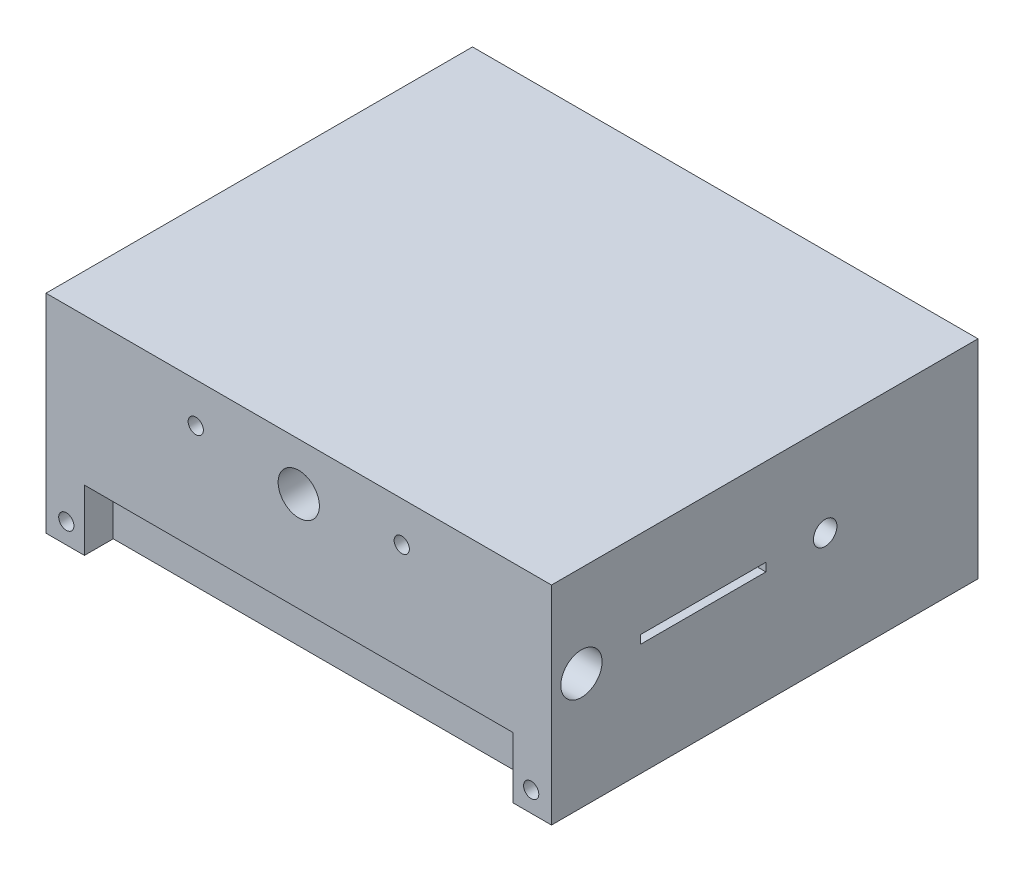
ISO-10303-21;
HEADER;
FILE_DESCRIPTION(('STEP AP214'),'2;1');
FILE_NAME('part.step','',(''),(''),'','','');
FILE_SCHEMA(('AUTOMOTIVE_DESIGN { 1 0 10303 214 1 1 1 1 }'));
ENDSEC;
DATA;
#1=APPLICATION_CONTEXT('core data for automotive mechanical design processes');
#2=APPLICATION_PROTOCOL_DEFINITION('international standard','automotive_design',2000,#1);
#3=PRODUCT_CONTEXT('',#1,'mechanical');
#4=PRODUCT('Part','Part','',(#3));
#5=PRODUCT_RELATED_PRODUCT_CATEGORY('part','',(#4));
#6=PRODUCT_DEFINITION_FORMATION('','',#4);
#7=PRODUCT_DEFINITION_CONTEXT('part definition',#1,'design');
#8=PRODUCT_DEFINITION('design','',#6,#7);
#9=PRODUCT_DEFINITION_SHAPE('','',#8);
#10=(LENGTH_UNIT() NAMED_UNIT(*) SI_UNIT(.MILLI.,.METRE.));
#11=(NAMED_UNIT(*) PLANE_ANGLE_UNIT() SI_UNIT($,.RADIAN.));
#12=(NAMED_UNIT(*) SI_UNIT($,.STERADIAN.) SOLID_ANGLE_UNIT());
#13=UNCERTAINTY_MEASURE_WITH_UNIT(LENGTH_MEASURE(1.E-05),#10,'distance_accuracy_value','');
#14=(GEOMETRIC_REPRESENTATION_CONTEXT(3) GLOBAL_UNCERTAINTY_ASSIGNED_CONTEXT((#13)) GLOBAL_UNIT_ASSIGNED_CONTEXT((#10,
#11,#12)) REPRESENTATION_CONTEXT('',''));
#15=CARTESIAN_POINT('',(0.,0.,0.));
#16=DIRECTION('',(0.,0.,1.));
#17=DIRECTION('',(1.,0.,0.));
#18=AXIS2_PLACEMENT_3D('',#15,#16,#17);
#19=CARTESIAN_POINT('',(316.09292636,-65.00344505,-133.35));
#20=DIRECTION('',(0.,0.,1.));
#21=DIRECTION('',(1.,0.,0.));
#22=AXIS2_PLACEMENT_3D('',#19,#20,#21);
#23=PLANE('',#22);
#24=CARTESIAN_POINT('',(93.639440102,39.990297972,-133.35));
#25=DIRECTION('',(0.,0.,1.));
#26=DIRECTION('',(1.,0.,0.));
#27=AXIS2_PLACEMENT_3D('',#24,#25,#26);
#28=CIRCLE('',#27,4.7625);
#29=CARTESIAN_POINT('',(98.401940102,39.990297972,-133.35));
#30=VERTEX_POINT('',#29);
#31=EDGE_CURVE('E313',#30,#30,#28,.T.);
#32=ORIENTED_EDGE('',*,*,#31,.T.);
#33=EDGE_LOOP('',(#32));
#34=FACE_BOUND('',#33,.T.);
#35=CARTESIAN_POINT('',(222.453486258,39.990297972,-133.35));
#36=DIRECTION('',(0.,0.,1.));
#37=DIRECTION('',(1.,0.,0.));
#38=AXIS2_PLACEMENT_3D('',#35,#36,#37);
#39=CIRCLE('',#38,4.76250000000001);
#40=CARTESIAN_POINT('',(227.215986258,39.990297972,-133.35));
#41=VERTEX_POINT('',#40);
#42=EDGE_CURVE('E285',#41,#41,#39,.T.);
#43=ORIENTED_EDGE('',*,*,#42,.T.);
#44=EDGE_LOOP('',(#43));
#45=FACE_BOUND('',#44,.T.);
#46=CARTESIAN_POINT('',(303.39292636,-52.30344505,-133.35));
#47=DIRECTION('',(0.,0.,1.));
#48=DIRECTION('',(1.,0.,0.));
#49=AXIS2_PLACEMENT_3D('',#46,#47,#48);
#50=CIRCLE('',#49,4.76250000000001);
#51=CARTESIAN_POINT('',(308.15542636,-52.30344505,-133.35));
#52=VERTEX_POINT('',#51);
#53=EDGE_CURVE('E293',#52,#52,#50,.T.);
#54=ORIENTED_EDGE('',*,*,#53,.T.);
#55=EDGE_LOOP('',(#54));
#56=FACE_BOUND('',#55,.T.);
#57=CARTESIAN_POINT('',(12.7,-52.30344505,-133.35));
#58=DIRECTION('',(0.,0.,1.));
#59=DIRECTION('',(1.,0.,0.));
#60=AXIS2_PLACEMENT_3D('',#57,#58,#59);
#61=CIRCLE('',#60,4.7625);
#62=CARTESIAN_POINT('',(17.4625,-52.30344505,-133.35));
#63=VERTEX_POINT('',#62);
#64=EDGE_CURVE('E301',#63,#63,#61,.T.);
#65=ORIENTED_EDGE('',*,*,#64,.T.);
#66=EDGE_LOOP('',(#65));
#67=FACE_BOUND('',#66,.T.);
#68=CARTESIAN_POINT('',(158.04646318,35.218991284,-133.35));
#69=DIRECTION('',(0.,0.,1.));
#70=DIRECTION('',(1.,0.,0.));
#71=AXIS2_PLACEMENT_3D('',#68,#69,#70);
#72=CIRCLE('',#71,12.8984375);
#73=CARTESIAN_POINT('',(170.94490068,35.218991284,-133.35));
#74=VERTEX_POINT('',#73);
#75=EDGE_CURVE('E309',#74,#74,#72,.T.);
#76=ORIENTED_EDGE('',*,*,#75,.T.);
#77=EDGE_LOOP('',(#76));
#78=FACE_BOUND('',#77,.T.);
#79=DIRECTION('',(0.,-1.,0.));
#80=VECTOR('',#79,1.);
#81=CARTESIAN_POINT('',(24.049603666,-65.00344505,-133.35));
#82=LINE('',#81,#80);
#83=CARTESIAN_POINT('',(24.049603666,-26.90344505,-133.35));
#84=VERTEX_POINT('',#83);
#85=CARTESIAN_POINT('',(24.049603666,-65.00344505,-133.35));
#86=VERTEX_POINT('',#85);
#87=EDGE_CURVE('E175',#84,#86,#82,.T.);
#88=ORIENTED_EDGE('',*,*,#87,.T.);
#89=DIRECTION('',(-1.,0.,0.));
#90=VECTOR('',#89,1.);
#91=CARTESIAN_POINT('',(316.09292636,-65.00344505,-133.35));
#92=LINE('',#91,#90);
#93=CARTESIAN_POINT('',(0.,-65.00344505,-133.35));
#94=VERTEX_POINT('',#93);
#95=EDGE_CURVE('E335',#86,#94,#92,.T.);
#96=ORIENTED_EDGE('',*,*,#95,.T.);
#97=DIRECTION('',(0.,1.,0.));
#98=VECTOR('',#97,1.);
#99=CARTESIAN_POINT('',(0.,-65.00344505,-133.35));
#100=LINE('',#99,#98);
#101=CARTESIAN_POINT('',(0.,65.00344505,-133.35));
#102=VERTEX_POINT('',#101);
#103=EDGE_CURVE('E317',#94,#102,#100,.T.);
#104=ORIENTED_EDGE('',*,*,#103,.T.);
#105=DIRECTION('',(-1.,0.,0.));
#106=VECTOR('',#105,1.);
#107=CARTESIAN_POINT('',(316.09292636,65.00344505,-133.35));
#108=LINE('',#107,#106);
#109=CARTESIAN_POINT('',(316.09292636,65.00344505,-133.35));
#110=VERTEX_POINT('',#109);
#111=EDGE_CURVE('E362',#110,#102,#108,.T.);
#112=ORIENTED_EDGE('',*,*,#111,.F.);
#113=DIRECTION('',(0.,1.,0.));
#114=VECTOR('',#113,1.);
#115=CARTESIAN_POINT('',(316.09292636,-65.00344505,-133.35));
#116=LINE('',#115,#114);
#117=CARTESIAN_POINT('',(316.09292636,-65.00344505,-133.35));
#118=VERTEX_POINT('',#117);
#119=EDGE_CURVE('E321',#118,#110,#116,.T.);
#120=ORIENTED_EDGE('',*,*,#119,.F.);
#121=CARTESIAN_POINT('',(292.043322694,-65.00344505,-133.35));
#122=VERTEX_POINT('',#121);
#123=EDGE_CURVE('E349',#118,#122,#92,.T.);
#124=ORIENTED_EDGE('',*,*,#123,.T.);
#125=DIRECTION('',(0.,1.,0.));
#126=VECTOR('',#125,1.);
#127=CARTESIAN_POINT('',(292.043322694,-65.00344505,-133.35));
#128=LINE('',#127,#126);
#129=CARTESIAN_POINT('',(292.043322694,-26.90344505,-133.35));
#130=VERTEX_POINT('',#129);
#131=EDGE_CURVE('E183',#122,#130,#128,.T.);
#132=ORIENTED_EDGE('',*,*,#131,.T.);
#133=DIRECTION('',(-1.,0.,0.));
#134=VECTOR('',#133,1.);
#135=CARTESIAN_POINT('',(24.049603666,-26.90344505,-133.35));
#136=LINE('',#135,#134);
#137=EDGE_CURVE('E187',#130,#84,#136,.T.);
#138=ORIENTED_EDGE('',*,*,#137,.T.);
#139=EDGE_LOOP('',(#88,#96,#104,#112,#120,#124,#132,#138));
#140=FACE_BOUND('',#139,.T.);
#141=ADVANCED_FACE('F44',(#34,#45,#56,#67,#78,#140),#23,.F.);
#142=CARTESIAN_POINT('',(316.09292636,-65.00344505,133.35));
#143=DIRECTION('',(0.,1.,0.));
#144=DIRECTION('',(0.,0.,1.));
#145=AXIS2_PLACEMENT_3D('',#142,#143,#144);
#146=PLANE('',#145);
#147=DIRECTION('',(0.,0.,-1.));
#148=VECTOR('',#147,1.);
#149=CARTESIAN_POINT('',(24.049603666,-65.00344505,-115.349999932));
#150=LINE('',#149,#148);
#151=CARTESIAN_POINT('',(24.049603666,-65.00344505,-115.349999932));
#152=VERTEX_POINT('',#151);
#153=EDGE_CURVE('E198',#152,#86,#150,.T.);
#154=ORIENTED_EDGE('',*,*,#153,.F.);
#155=DIRECTION('',(1.,0.,0.));
#156=VECTOR('',#155,1.);
#157=CARTESIAN_POINT('',(24.049603666,-65.00344505,-115.349999932));
#158=LINE('',#157,#156);
#159=CARTESIAN_POINT('',(292.043322694,-65.00344505,-115.349999932));
#160=VERTEX_POINT('',#159);
#161=EDGE_CURVE('E178',#152,#160,#158,.T.);
#162=ORIENTED_EDGE('',*,*,#161,.T.);
#163=DIRECTION('',(0.,0.,-1.));
#164=VECTOR('',#163,1.);
#165=CARTESIAN_POINT('',(292.043322694,-65.00344505,-115.349999932));
#166=LINE('',#165,#164);
#167=EDGE_CURVE('E202',#160,#122,#166,.T.);
#168=ORIENTED_EDGE('',*,*,#167,.T.);
#169=ORIENTED_EDGE('',*,*,#123,.F.);
#170=DIRECTION('',(0.,0.,-1.));
#171=VECTOR('',#170,1.);
#172=CARTESIAN_POINT('',(316.09292636,-65.00344505,133.35));
#173=LINE('',#172,#171);
#174=CARTESIAN_POINT('',(316.09292636,-65.00344505,133.35));
#175=VERTEX_POINT('',#174);
#176=EDGE_CURVE('E332',#175,#118,#173,.T.);
#177=ORIENTED_EDGE('',*,*,#176,.F.);
#178=DIRECTION('',(-1.,0.,0.));
#179=VECTOR('',#178,1.);
#180=CARTESIAN_POINT('',(316.09292636,-65.00344505,133.35));
#181=LINE('',#180,#179);
#182=CARTESIAN_POINT('',(292.043322694,-65.00344505,133.35));
#183=VERTEX_POINT('',#182);
#184=EDGE_CURVE('E354',#175,#183,#181,.T.);
#185=ORIENTED_EDGE('',*,*,#184,.T.);
#186=DIRECTION('',(0.,0.,1.));
#187=VECTOR('',#186,1.);
#188=CARTESIAN_POINT('',(292.043322694,-65.00344505,115.349999932));
#189=LINE('',#188,#187);
#190=CARTESIAN_POINT('',(292.043322694,-65.00344505,115.349999932));
#191=VERTEX_POINT('',#190);
#192=EDGE_CURVE('E238',#191,#183,#189,.T.);
#193=ORIENTED_EDGE('',*,*,#192,.F.);
#194=DIRECTION('',(1.,0.,0.));
#195=VECTOR('',#194,1.);
#196=CARTESIAN_POINT('',(24.049603666,-65.00344505,115.349999932));
#197=LINE('',#196,#195);
#198=CARTESIAN_POINT('',(24.049603666,-65.00344505,115.349999932));
#199=VERTEX_POINT('',#198);
#200=EDGE_CURVE('E210',#199,#191,#197,.T.);
#201=ORIENTED_EDGE('',*,*,#200,.F.);
#202=DIRECTION('',(0.,0.,1.));
#203=VECTOR('',#202,1.);
#204=CARTESIAN_POINT('',(24.049603666,-65.00344505,115.349999932));
#205=LINE('',#204,#203);
#206=CARTESIAN_POINT('',(24.049603666,-65.00344505,133.35));
#207=VERTEX_POINT('',#206);
#208=EDGE_CURVE('E221',#199,#207,#205,.T.);
#209=ORIENTED_EDGE('',*,*,#208,.T.);
#210=CARTESIAN_POINT('',(0.,-65.00344505,133.35));
#211=VERTEX_POINT('',#210);
#212=EDGE_CURVE('E353',#207,#211,#181,.T.);
#213=ORIENTED_EDGE('',*,*,#212,.T.);
#214=DIRECTION('',(0.,0.,-1.));
#215=VECTOR('',#214,1.);
#216=CARTESIAN_POINT('',(0.,-65.00344505,133.35));
#217=LINE('',#216,#215);
#218=EDGE_CURVE('E326',#211,#94,#217,.T.);
#219=ORIENTED_EDGE('',*,*,#218,.T.);
#220=ORIENTED_EDGE('',*,*,#95,.F.);
#221=EDGE_LOOP('',(#154,#162,#168,#169,#177,#185,#193,#201,#209,#213,#219,#220));
#222=FACE_BOUND('',#221,.T.);
#223=ADVANCED_FACE('F405',(#222),#146,.F.);
#224=CARTESIAN_POINT('',(316.09292636,65.00344505,133.35));
#225=DIRECTION('',(0.,-1.,0.));
#226=DIRECTION('',(0.,0.,-1.));
#227=AXIS2_PLACEMENT_3D('',#224,#225,#226);
#228=PLANE('',#227);
#229=DIRECTION('',(0.,0.,1.));
#230=VECTOR('',#229,1.);
#231=CARTESIAN_POINT('',(0.,65.00344505,133.35));
#232=LINE('',#231,#230);
#233=CARTESIAN_POINT('',(0.,65.00344505,133.35));
#234=VERTEX_POINT('',#233);
#235=EDGE_CURVE('E339',#102,#234,#232,.T.);
#236=ORIENTED_EDGE('',*,*,#235,.T.);
#237=DIRECTION('',(-1.,0.,0.));
#238=VECTOR('',#237,1.);
#239=CARTESIAN_POINT('',(316.09292636,65.00344505,133.35));
#240=LINE('',#239,#238);
#241=CARTESIAN_POINT('',(316.09292636,65.00344505,133.35));
#242=VERTEX_POINT('',#241);
#243=EDGE_CURVE('E358',#242,#234,#240,.T.);
#244=ORIENTED_EDGE('',*,*,#243,.F.);
#245=DIRECTION('',(0.,0.,1.));
#246=VECTOR('',#245,1.);
#247=CARTESIAN_POINT('',(316.09292636,65.00344505,133.35));
#248=LINE('',#247,#246);
#249=EDGE_CURVE('E325',#110,#242,#248,.T.);
#250=ORIENTED_EDGE('',*,*,#249,.F.);
#251=ORIENTED_EDGE('',*,*,#111,.T.);
#252=EDGE_LOOP('',(#236,#244,#250,#251));
#253=FACE_BOUND('',#252,.T.);
#254=ADVANCED_FACE('F416',(#253),#228,.F.);
#255=CARTESIAN_POINT('',(316.09292636,-65.00344505,133.35));
#256=DIRECTION('',(0.,0.,-1.));
#257=DIRECTION('',(-1.,0.,0.));
#258=AXIS2_PLACEMENT_3D('',#255,#256,#257);
#259=PLANE('',#258);
#260=CARTESIAN_POINT('',(158.04646318,35.218991284,133.35));
#261=DIRECTION('',(0.,0.,1.));
#262=DIRECTION('',(1.,0.,0.));
#263=AXIS2_PLACEMENT_3D('',#260,#261,#262);
#264=CIRCLE('',#263,12.8984375);
#265=CARTESIAN_POINT('',(170.94490068,35.218991284,133.35));
#266=VERTEX_POINT('',#265);
#267=EDGE_CURVE('E305',#266,#266,#264,.T.);
#268=ORIENTED_EDGE('',*,*,#267,.F.);
#269=EDGE_LOOP('',(#268));
#270=FACE_BOUND('',#269,.T.);
#271=CARTESIAN_POINT('',(12.7,-52.30344505,133.35));
#272=DIRECTION('',(0.,0.,1.));
#273=DIRECTION('',(1.,0.,0.));
#274=AXIS2_PLACEMENT_3D('',#271,#272,#273);
#275=CIRCLE('',#274,4.7625);
#276=CARTESIAN_POINT('',(17.4625,-52.30344505,133.35));
#277=VERTEX_POINT('',#276);
#278=EDGE_CURVE('E297',#277,#277,#275,.T.);
#279=ORIENTED_EDGE('',*,*,#278,.F.);
#280=EDGE_LOOP('',(#279));
#281=FACE_BOUND('',#280,.T.);
#282=CARTESIAN_POINT('',(303.39292636,-52.30344505,133.35));
#283=DIRECTION('',(0.,0.,1.));
#284=DIRECTION('',(1.,0.,0.));
#285=AXIS2_PLACEMENT_3D('',#282,#283,#284);
#286=CIRCLE('',#285,4.76250000000001);
#287=CARTESIAN_POINT('',(308.15542636,-52.30344505,133.35));
#288=VERTEX_POINT('',#287);
#289=EDGE_CURVE('E289',#288,#288,#286,.T.);
#290=ORIENTED_EDGE('',*,*,#289,.F.);
#291=EDGE_LOOP('',(#290));
#292=FACE_BOUND('',#291,.T.);
#293=CARTESIAN_POINT('',(222.453486258,39.990297972,133.35));
#294=DIRECTION('',(0.,0.,1.));
#295=DIRECTION('',(1.,0.,0.));
#296=AXIS2_PLACEMENT_3D('',#293,#294,#295);
#297=CIRCLE('',#296,4.76250000000001);
#298=CARTESIAN_POINT('',(227.215986258,39.990297972,133.35));
#299=VERTEX_POINT('',#298);
#300=EDGE_CURVE('E280',#299,#299,#297,.T.);
#301=ORIENTED_EDGE('',*,*,#300,.F.);
#302=EDGE_LOOP('',(#301));
#303=FACE_BOUND('',#302,.T.);
#304=CARTESIAN_POINT('',(93.639440102,39.990297972,133.35));
#305=DIRECTION('',(0.,0.,1.));
#306=DIRECTION('',(1.,0.,0.));
#307=AXIS2_PLACEMENT_3D('',#304,#305,#306);
#308=CIRCLE('',#307,4.7625);
#309=CARTESIAN_POINT('',(98.401940102,39.990297972,133.35));
#310=VERTEX_POINT('',#309);
#311=EDGE_CURVE('E284',#310,#310,#308,.T.);
#312=ORIENTED_EDGE('',*,*,#311,.F.);
#313=EDGE_LOOP('',(#312));
#314=FACE_BOUND('',#313,.T.);
#315=ORIENTED_EDGE('',*,*,#212,.F.);
#316=DIRECTION('',(0.,-1.,0.));
#317=VECTOR('',#316,1.);
#318=CARTESIAN_POINT('',(24.049603666,-65.00344505,133.35));
#319=LINE('',#318,#317);
#320=CARTESIAN_POINT('',(24.049603666,-26.90344505,133.35));
#321=VERTEX_POINT('',#320);
#322=EDGE_CURVE('E201',#321,#207,#319,.T.);
#323=ORIENTED_EDGE('',*,*,#322,.F.);
#324=DIRECTION('',(-1.,0.,0.));
#325=VECTOR('',#324,1.);
#326=CARTESIAN_POINT('',(24.049603666,-26.90344505,133.35));
#327=LINE('',#326,#325);
#328=CARTESIAN_POINT('',(292.043322694,-26.90344505,133.35));
#329=VERTEX_POINT('',#328);
#330=EDGE_CURVE('E211',#329,#321,#327,.T.);
#331=ORIENTED_EDGE('',*,*,#330,.F.);
#332=DIRECTION('',(0.,1.,0.));
#333=VECTOR('',#332,1.);
#334=CARTESIAN_POINT('',(292.043322694,-65.00344505,133.35));
#335=LINE('',#334,#333);
#336=EDGE_CURVE('E224',#183,#329,#335,.T.);
#337=ORIENTED_EDGE('',*,*,#336,.F.);
#338=ORIENTED_EDGE('',*,*,#184,.F.);
#339=DIRECTION('',(0.,-1.,0.));
#340=VECTOR('',#339,1.);
#341=CARTESIAN_POINT('',(316.09292636,-65.00344505,133.35));
#342=LINE('',#341,#340);
#343=EDGE_CURVE('E329',#242,#175,#342,.T.);
#344=ORIENTED_EDGE('',*,*,#343,.F.);
#345=ORIENTED_EDGE('',*,*,#243,.T.);
#346=DIRECTION('',(0.,-1.,0.));
#347=VECTOR('',#346,1.);
#348=CARTESIAN_POINT('',(0.,-65.00344505,133.35));
#349=LINE('',#348,#347);
#350=EDGE_CURVE('E342',#234,#211,#349,.T.);
#351=ORIENTED_EDGE('',*,*,#350,.T.);
#352=EDGE_LOOP('',(#315,#323,#331,#337,#338,#344,#345,#351));
#353=FACE_BOUND('',#352,.T.);
#354=ADVANCED_FACE('F411',(#270,#281,#292,#303,#314,#353),#259,.F.);
#355=CARTESIAN_POINT('',(316.09292636,0.,0.));
#356=DIRECTION('',(-1.,0.,0.));
#357=DIRECTION('',(0.,0.,1.));
#358=AXIS2_PLACEMENT_3D('',#355,#356,#357);
#359=PLANE('',#358);
#360=CARTESIAN_POINT('',(316.09292636,7.67564504999998,114.617463678));
#361=DIRECTION('',(1.,0.,0.));
#362=DIRECTION('',(0.,0.,-1.));
#363=AXIS2_PLACEMENT_3D('',#360,#361,#362);
#364=CIRCLE('',#363,12.8984375);
#365=CARTESIAN_POINT('',(316.09292636,7.67564504999998,101.719026178));
#366=VERTEX_POINT('',#365);
#367=EDGE_CURVE('E244',#366,#366,#364,.T.);
#368=ORIENTED_EDGE('',*,*,#367,.F.);
#369=EDGE_LOOP('',(#368));
#370=FACE_BOUND('',#369,.T.);
#371=CARTESIAN_POINT('',(316.09292636,7.67564505,-37.782536322));
#372=DIRECTION('',(1.,0.,0.));
#373=DIRECTION('',(0.,0.,-1.));
#374=AXIS2_PLACEMENT_3D('',#371,#372,#373);
#375=CIRCLE('',#374,7.3421875);
#376=CARTESIAN_POINT('',(316.09292636,7.67564505,-45.124723822));
#377=VERTEX_POINT('',#376);
#378=EDGE_CURVE('E249',#377,#377,#375,.T.);
#379=ORIENTED_EDGE('',*,*,#378,.F.);
#380=EDGE_LOOP('',(#379));
#381=FACE_BOUND('',#380,.T.);
#382=DIRECTION('',(0.,0.,1.));
#383=VECTOR('',#382,1.);
#384=CARTESIAN_POINT('',(316.09292636,10.306895058,77.561250008));
#385=LINE('',#384,#383);
#386=CARTESIAN_POINT('',(316.09292636,10.306895058,-0.726250007999987));
#387=VERTEX_POINT('',#386);
#388=CARTESIAN_POINT('',(316.09292636,10.306895058,77.561250008));
#389=VERTEX_POINT('',#388);
#390=EDGE_CURVE('E274',#387,#389,#385,.T.);
#391=ORIENTED_EDGE('',*,*,#390,.F.);
#392=DIRECTION('',(0.,1.,0.));
#393=VECTOR('',#392,1.);
#394=CARTESIAN_POINT('',(316.09292636,5.04439504199999,-0.726250007999987));
#395=LINE('',#394,#393);
#396=CARTESIAN_POINT('',(316.09292636,5.04439504199999,-0.726250007999987));
#397=VERTEX_POINT('',#396);
#398=EDGE_CURVE('E253',#397,#387,#395,.T.);
#399=ORIENTED_EDGE('',*,*,#398,.F.);
#400=DIRECTION('',(0.,0.,-1.));
#401=VECTOR('',#400,1.);
#402=CARTESIAN_POINT('',(316.09292636,5.04439504199998,77.561250008));
#403=LINE('',#402,#401);
#404=CARTESIAN_POINT('',(316.09292636,5.04439504199998,77.561250008));
#405=VERTEX_POINT('',#404);
#406=EDGE_CURVE('E258',#405,#397,#403,.T.);
#407=ORIENTED_EDGE('',*,*,#406,.F.);
#408=DIRECTION('',(0.,-1.,0.));
#409=VECTOR('',#408,1.);
#410=CARTESIAN_POINT('',(316.09292636,5.04439504199998,77.561250008));
#411=LINE('',#410,#409);
#412=EDGE_CURVE('E270',#389,#405,#411,.T.);
#413=ORIENTED_EDGE('',*,*,#412,.F.);
#414=EDGE_LOOP('',(#391,#399,#407,#413));
#415=FACE_BOUND('',#414,.T.);
#416=ORIENTED_EDGE('',*,*,#119,.T.);
#417=ORIENTED_EDGE('',*,*,#249,.T.);
#418=ORIENTED_EDGE('',*,*,#343,.T.);
#419=ORIENTED_EDGE('',*,*,#176,.T.);
#420=EDGE_LOOP('',(#416,#417,#418,#419));
#421=FACE_BOUND('',#420,.T.);
#422=ADVANCED_FACE('F389',(#370,#381,#415,#421),#359,.F.);
#423=CARTESIAN_POINT('',(0.,0.,0.));
#424=DIRECTION('',(-1.,0.,0.));
#425=DIRECTION('',(0.,0.,1.));
#426=AXIS2_PLACEMENT_3D('',#423,#424,#425);
#427=PLANE('',#426);
#428=CARTESIAN_POINT('',(0.,7.67564504999998,114.617463678));
#429=DIRECTION('',(-1.,0.,0.));
#430=DIRECTION('',(0.,0.,1.));
#431=AXIS2_PLACEMENT_3D('',#428,#429,#430);
#432=CIRCLE('',#431,12.8984375);
#433=CARTESIAN_POINT('',(0.,7.67564504999998,127.515901178));
#434=VERTEX_POINT('',#433);
#435=EDGE_CURVE('E47',#434,#434,#432,.T.);
#436=ORIENTED_EDGE('',*,*,#435,.F.);
#437=EDGE_LOOP('',(#436));
#438=FACE_BOUND('',#437,.T.);
#439=CARTESIAN_POINT('',(0.,7.67564505,-37.782536322));
#440=DIRECTION('',(-1.,0.,0.));
#441=DIRECTION('',(0.,0.,1.));
#442=AXIS2_PLACEMENT_3D('',#439,#440,#441);
#443=CIRCLE('',#442,7.3421875);
#444=CARTESIAN_POINT('',(0.,7.67564505,-30.440348822));
#445=VERTEX_POINT('',#444);
#446=EDGE_CURVE('E248',#445,#445,#443,.T.);
#447=ORIENTED_EDGE('',*,*,#446,.F.);
#448=EDGE_LOOP('',(#447));
#449=FACE_BOUND('',#448,.T.);
#450=DIRECTION('',(0.,-1.,0.));
#451=VECTOR('',#450,1.);
#452=CARTESIAN_POINT('',(0.,0.,-0.726250007999987));
#453=LINE('',#452,#451);
#454=CARTESIAN_POINT('',(0.,10.306895058,-0.726250007999987));
#455=VERTEX_POINT('',#454);
#456=CARTESIAN_POINT('',(0.,5.04439504199999,-0.726250007999987));
#457=VERTEX_POINT('',#456);
#458=EDGE_CURVE('E11',#455,#457,#453,.T.);
#459=ORIENTED_EDGE('',*,*,#458,.F.);
#460=DIRECTION('',(0.,0.,-1.));
#461=VECTOR('',#460,1.);
#462=CARTESIAN_POINT('',(0.,10.306895058,0.));
#463=LINE('',#462,#461);
#464=CARTESIAN_POINT('',(0.,10.306895058,77.561250008));
#465=VERTEX_POINT('',#464);
#466=EDGE_CURVE('E366',#465,#455,#463,.T.);
#467=ORIENTED_EDGE('',*,*,#466,.F.);
#468=DIRECTION('',(0.,1.,0.));
#469=VECTOR('',#468,1.);
#470=CARTESIAN_POINT('',(0.,0.,77.561250008));
#471=LINE('',#470,#469);
#472=CARTESIAN_POINT('',(0.,5.04439504199998,77.561250008));
#473=VERTEX_POINT('',#472);
#474=EDGE_CURVE('E369',#473,#465,#471,.T.);
#475=ORIENTED_EDGE('',*,*,#474,.F.);
#476=DIRECTION('',(0.,0.,1.));
#477=VECTOR('',#476,1.);
#478=CARTESIAN_POINT('',(0.,5.04439504199999,0.));
#479=LINE('',#478,#477);
#480=EDGE_CURVE('E53',#457,#473,#479,.T.);
#481=ORIENTED_EDGE('',*,*,#480,.F.);
#482=EDGE_LOOP('',(#459,#467,#475,#481));
#483=FACE_BOUND('',#482,.T.);
#484=ORIENTED_EDGE('',*,*,#103,.F.);
#485=ORIENTED_EDGE('',*,*,#218,.F.);
#486=ORIENTED_EDGE('',*,*,#350,.F.);
#487=ORIENTED_EDGE('',*,*,#235,.F.);
#488=EDGE_LOOP('',(#484,#485,#486,#487));
#489=FACE_BOUND('',#488,.T.);
#490=ADVANCED_FACE('F385',(#438,#449,#483,#489),#427,.T.);
#491=CARTESIAN_POINT('',(93.639440102,39.990297972,-133.35));
#492=DIRECTION('',(0.,0.,1.));
#493=DIRECTION('',(1.,0.,0.));
#494=AXIS2_PLACEMENT_3D('',#491,#492,#493);
#495=CYLINDRICAL_SURFACE('',#494,4.7625);
#496=ORIENTED_EDGE('',*,*,#31,.F.);
#497=EDGE_LOOP('',(#496));
#498=FACE_BOUND('',#497,.T.);
#499=ORIENTED_EDGE('',*,*,#311,.T.);
#500=EDGE_LOOP('',(#499));
#501=FACE_BOUND('',#500,.T.);
#502=ADVANCED_FACE('F388',(#498,#501),#495,.F.);
#503=CARTESIAN_POINT('',(222.453486258,39.990297972,-133.35));
#504=DIRECTION('',(0.,0.,1.));
#505=DIRECTION('',(1.,0.,0.));
#506=AXIS2_PLACEMENT_3D('',#503,#504,#505);
#507=CYLINDRICAL_SURFACE('',#506,4.76250000000001);
#508=ORIENTED_EDGE('',*,*,#42,.F.);
#509=EDGE_LOOP('',(#508));
#510=FACE_BOUND('',#509,.T.);
#511=ORIENTED_EDGE('',*,*,#300,.T.);
#512=EDGE_LOOP('',(#511));
#513=FACE_BOUND('',#512,.T.);
#514=ADVANCED_FACE('F469',(#510,#513),#507,.F.);
#515=CARTESIAN_POINT('',(303.39292636,-52.30344505,-133.35));
#516=DIRECTION('',(0.,0.,1.));
#517=DIRECTION('',(1.,0.,0.));
#518=AXIS2_PLACEMENT_3D('',#515,#516,#517);
#519=CYLINDRICAL_SURFACE('',#518,4.76250000000001);
#520=ORIENTED_EDGE('',*,*,#53,.F.);
#521=EDGE_LOOP('',(#520));
#522=FACE_BOUND('',#521,.T.);
#523=ORIENTED_EDGE('',*,*,#289,.T.);
#524=EDGE_LOOP('',(#523));
#525=FACE_BOUND('',#524,.T.);
#526=ADVANCED_FACE('F476',(#522,#525),#519,.F.);
#527=CARTESIAN_POINT('',(12.7,-52.30344505,-133.35));
#528=DIRECTION('',(0.,0.,1.));
#529=DIRECTION('',(1.,0.,0.));
#530=AXIS2_PLACEMENT_3D('',#527,#528,#529);
#531=CYLINDRICAL_SURFACE('',#530,4.7625);
#532=ORIENTED_EDGE('',*,*,#64,.F.);
#533=EDGE_LOOP('',(#532));
#534=FACE_BOUND('',#533,.T.);
#535=ORIENTED_EDGE('',*,*,#278,.T.);
#536=EDGE_LOOP('',(#535));
#537=FACE_BOUND('',#536,.T.);
#538=ADVANCED_FACE('F453',(#534,#537),#531,.F.);
#539=CARTESIAN_POINT('',(158.04646318,35.218991284,-133.35));
#540=DIRECTION('',(0.,0.,1.));
#541=DIRECTION('',(1.,0.,0.));
#542=AXIS2_PLACEMENT_3D('',#539,#540,#541);
#543=CYLINDRICAL_SURFACE('',#542,12.8984375);
#544=ORIENTED_EDGE('',*,*,#75,.F.);
#545=EDGE_LOOP('',(#544));
#546=FACE_BOUND('',#545,.T.);
#547=ORIENTED_EDGE('',*,*,#267,.T.);
#548=EDGE_LOOP('',(#547));
#549=FACE_BOUND('',#548,.T.);
#550=ADVANCED_FACE('F449',(#546,#549),#543,.F.);
#551=CARTESIAN_POINT('',(-16.6470736399997,5.04439504199999,-0.726250007999987));
#552=DIRECTION('',(0.,0.,-1.));
#553=DIRECTION('',(-1.,0.,0.));
#554=AXIS2_PLACEMENT_3D('',#551,#552,#553);
#555=PLANE('',#554);
#556=ORIENTED_EDGE('',*,*,#458,.T.);
#557=DIRECTION('',(1.,0.,0.));
#558=VECTOR('',#557,1.);
#559=CARTESIAN_POINT('',(-16.6470736399997,5.04439504199999,-0.726250007999987));
#560=LINE('',#559,#558);
#561=EDGE_CURVE('E234',#457,#397,#560,.T.);
#562=ORIENTED_EDGE('',*,*,#561,.T.);
#563=ORIENTED_EDGE('',*,*,#398,.T.);
#564=DIRECTION('',(1.,0.,0.));
#565=VECTOR('',#564,1.);
#566=CARTESIAN_POINT('',(-16.6470736399997,10.306895058,-0.726250007999987));
#567=LINE('',#566,#565);
#568=EDGE_CURVE('E254',#455,#387,#567,.T.);
#569=ORIENTED_EDGE('',*,*,#568,.F.);
#570=EDGE_LOOP('',(#556,#562,#563,#569));
#571=FACE_BOUND('',#570,.T.);
#572=ADVANCED_FACE('F452',(#571),#555,.F.);
#573=CARTESIAN_POINT('',(-16.6470736399997,5.04439504199998,77.561250008));
#574=DIRECTION('',(0.,-1.,0.));
#575=DIRECTION('',(0.,0.,-1.));
#576=AXIS2_PLACEMENT_3D('',#573,#574,#575);
#577=PLANE('',#576);
#578=ORIENTED_EDGE('',*,*,#480,.T.);
#579=DIRECTION('',(1.,0.,0.));
#580=VECTOR('',#579,1.);
#581=CARTESIAN_POINT('',(-16.6470736399997,5.04439504199998,77.561250008));
#582=LINE('',#581,#580);
#583=EDGE_CURVE('E262',#473,#405,#582,.T.);
#584=ORIENTED_EDGE('',*,*,#583,.T.);
#585=ORIENTED_EDGE('',*,*,#406,.T.);
#586=ORIENTED_EDGE('',*,*,#561,.F.);
#587=EDGE_LOOP('',(#578,#584,#585,#586));
#588=FACE_BOUND('',#587,.T.);
#589=ADVANCED_FACE('F548',(#588),#577,.F.);
#590=CARTESIAN_POINT('',(-16.6470736399997,5.04439504199998,77.561250008));
#591=DIRECTION('',(0.,0.,1.));
#592=DIRECTION('',(1.,0.,0.));
#593=AXIS2_PLACEMENT_3D('',#590,#591,#592);
#594=PLANE('',#593);
#595=ORIENTED_EDGE('',*,*,#474,.T.);
#596=DIRECTION('',(1.,0.,0.));
#597=VECTOR('',#596,1.);
#598=CARTESIAN_POINT('',(-16.6470736399997,10.306895058,77.561250008));
#599=LINE('',#598,#597);
#600=EDGE_CURVE('E259',#465,#389,#599,.T.);
#601=ORIENTED_EDGE('',*,*,#600,.T.);
#602=ORIENTED_EDGE('',*,*,#412,.T.);
#603=ORIENTED_EDGE('',*,*,#583,.F.);
#604=EDGE_LOOP('',(#595,#601,#602,#603));
#605=FACE_BOUND('',#604,.T.);
#606=ADVANCED_FACE('F558',(#605),#594,.F.);
#607=CARTESIAN_POINT('',(-16.6470736399997,10.306895058,77.561250008));
#608=DIRECTION('',(0.,1.,0.));
#609=DIRECTION('',(0.,0.,1.));
#610=AXIS2_PLACEMENT_3D('',#607,#608,#609);
#611=PLANE('',#610);
#612=ORIENTED_EDGE('',*,*,#466,.T.);
#613=ORIENTED_EDGE('',*,*,#568,.T.);
#614=ORIENTED_EDGE('',*,*,#390,.T.);
#615=ORIENTED_EDGE('',*,*,#600,.F.);
#616=EDGE_LOOP('',(#612,#613,#614,#615));
#617=FACE_BOUND('',#616,.T.);
#618=ADVANCED_FACE('F568',(#617),#611,.F.);
#619=CARTESIAN_POINT('',(-16.6470736399997,7.67564505,-37.782536322));
#620=DIRECTION('',(1.,0.,0.));
#621=DIRECTION('',(0.,0.,-1.));
#622=AXIS2_PLACEMENT_3D('',#619,#620,#621);
#623=CYLINDRICAL_SURFACE('',#622,7.3421875);
#624=ORIENTED_EDGE('',*,*,#446,.T.);
#625=EDGE_LOOP('',(#624));
#626=FACE_BOUND('',#625,.T.);
#627=ORIENTED_EDGE('',*,*,#378,.T.);
#628=EDGE_LOOP('',(#627));
#629=FACE_BOUND('',#628,.T.);
#630=ADVANCED_FACE('F578',(#626,#629),#623,.F.);
#631=CARTESIAN_POINT('',(-16.6470736399997,7.67564504999998,114.617463678));
#632=DIRECTION('',(1.,0.,0.));
#633=DIRECTION('',(0.,0.,-1.));
#634=AXIS2_PLACEMENT_3D('',#631,#632,#633);
#635=CYLINDRICAL_SURFACE('',#634,12.8984375);
#636=ORIENTED_EDGE('',*,*,#435,.T.);
#637=EDGE_LOOP('',(#636));
#638=FACE_BOUND('',#637,.T.);
#639=ORIENTED_EDGE('',*,*,#367,.T.);
#640=EDGE_LOOP('',(#639));
#641=FACE_BOUND('',#640,.T.);
#642=ADVANCED_FACE('F382',(#638,#641),#635,.F.);
#643=CARTESIAN_POINT('',(24.049603666,-65.00344505,115.349999932));
#644=DIRECTION('',(-1.,0.,0.));
#645=DIRECTION('',(0.,0.,1.));
#646=AXIS2_PLACEMENT_3D('',#643,#644,#645);
#647=PLANE('',#646);
#648=ORIENTED_EDGE('',*,*,#322,.T.);
#649=ORIENTED_EDGE('',*,*,#208,.F.);
#650=DIRECTION('',(0.,-1.,0.));
#651=VECTOR('',#650,1.);
#652=CARTESIAN_POINT('',(24.049603666,-65.00344505,115.349999932));
#653=LINE('',#652,#651);
#654=CARTESIAN_POINT('',(24.049603666,-26.90344505,115.349999932));
#655=VERTEX_POINT('',#654);
#656=EDGE_CURVE('E69',#655,#199,#653,.T.);
#657=ORIENTED_EDGE('',*,*,#656,.F.);
#658=DIRECTION('',(0.,0.,1.));
#659=VECTOR('',#658,1.);
#660=CARTESIAN_POINT('',(24.049603666,-26.90344505,115.349999932));
#661=LINE('',#660,#659);
#662=EDGE_CURVE('E231',#655,#321,#661,.T.);
#663=ORIENTED_EDGE('',*,*,#662,.T.);
#664=EDGE_LOOP('',(#648,#649,#657,#663));
#665=FACE_BOUND('',#664,.T.);
#666=ADVANCED_FACE('F595',(#665),#647,.F.);
#667=CARTESIAN_POINT('',(24.049603666,-26.90344505,115.349999932));
#668=DIRECTION('',(0.,1.,0.));
#669=DIRECTION('',(0.,0.,1.));
#670=AXIS2_PLACEMENT_3D('',#667,#668,#669);
#671=PLANE('',#670);
#672=ORIENTED_EDGE('',*,*,#330,.T.);
#673=ORIENTED_EDGE('',*,*,#662,.F.);
#674=DIRECTION('',(-1.,0.,0.));
#675=VECTOR('',#674,1.);
#676=CARTESIAN_POINT('',(24.049603666,-26.90344505,115.349999932));
#677=LINE('',#676,#675);
#678=CARTESIAN_POINT('',(292.043322694,-26.90344505,115.349999932));
#679=VERTEX_POINT('',#678);
#680=EDGE_CURVE('E218',#679,#655,#677,.T.);
#681=ORIENTED_EDGE('',*,*,#680,.F.);
#682=DIRECTION('',(0.,0.,1.));
#683=VECTOR('',#682,1.);
#684=CARTESIAN_POINT('',(292.043322694,-26.90344505,115.349999932));
#685=LINE('',#684,#683);
#686=EDGE_CURVE('E235',#679,#329,#685,.T.);
#687=ORIENTED_EDGE('',*,*,#686,.T.);
#688=EDGE_LOOP('',(#672,#673,#681,#687));
#689=FACE_BOUND('',#688,.T.);
#690=ADVANCED_FACE('F603',(#689),#671,.F.);
#691=CARTESIAN_POINT('',(292.043322694,-65.00344505,115.349999932));
#692=DIRECTION('',(1.,0.,0.));
#693=DIRECTION('',(0.,0.,-1.));
#694=AXIS2_PLACEMENT_3D('',#691,#692,#693);
#695=PLANE('',#694);
#696=ORIENTED_EDGE('',*,*,#336,.T.);
#697=ORIENTED_EDGE('',*,*,#686,.F.);
#698=DIRECTION('',(0.,1.,0.));
#699=VECTOR('',#698,1.);
#700=CARTESIAN_POINT('',(292.043322694,-65.00344505,115.349999932));
#701=LINE('',#700,#699);
#702=EDGE_CURVE('E214',#191,#679,#701,.T.);
#703=ORIENTED_EDGE('',*,*,#702,.F.);
#704=ORIENTED_EDGE('',*,*,#192,.T.);
#705=EDGE_LOOP('',(#696,#697,#703,#704));
#706=FACE_BOUND('',#705,.T.);
#707=ADVANCED_FACE('F613',(#706),#695,.F.);
#708=CARTESIAN_POINT('',(0.,0.,115.349999932));
#709=DIRECTION('',(0.,0.,-1.));
#710=DIRECTION('',(-1.,0.,0.));
#711=AXIS2_PLACEMENT_3D('',#708,#709,#710);
#712=PLANE('',#711);
#713=ORIENTED_EDGE('',*,*,#656,.T.);
#714=ORIENTED_EDGE('',*,*,#200,.T.);
#715=ORIENTED_EDGE('',*,*,#702,.T.);
#716=ORIENTED_EDGE('',*,*,#680,.T.);
#717=EDGE_LOOP('',(#713,#714,#715,#716));
#718=FACE_BOUND('',#717,.T.);
#719=ADVANCED_FACE('F429',(#718),#712,.F.);
#720=CARTESIAN_POINT('',(24.049603666,-65.00344505,-115.349999932));
#721=DIRECTION('',(1.,0.,0.));
#722=DIRECTION('',(0.,0.,-1.));
#723=AXIS2_PLACEMENT_3D('',#720,#721,#722);
#724=PLANE('',#723);
#725=ORIENTED_EDGE('',*,*,#87,.F.);
#726=DIRECTION('',(0.,0.,-1.));
#727=VECTOR('',#726,1.);
#728=CARTESIAN_POINT('',(24.049603666,-26.90344505,-115.349999932));
#729=LINE('',#728,#727);
#730=CARTESIAN_POINT('',(24.049603666,-26.90344505,-115.349999932));
#731=VERTEX_POINT('',#730);
#732=EDGE_CURVE('E163',#731,#84,#729,.T.);
#733=ORIENTED_EDGE('',*,*,#732,.F.);
#734=DIRECTION('',(0.,-1.,0.));
#735=VECTOR('',#734,1.);
#736=CARTESIAN_POINT('',(24.049603666,-65.00344505,-115.349999932));
#737=LINE('',#736,#735);
#738=EDGE_CURVE('E168',#731,#152,#737,.T.);
#739=ORIENTED_EDGE('',*,*,#738,.T.);
#740=ORIENTED_EDGE('',*,*,#153,.T.);
#741=EDGE_LOOP('',(#725,#733,#739,#740));
#742=FACE_BOUND('',#741,.T.);
#743=ADVANCED_FACE('F172',(#742),#724,.T.);
#744=CARTESIAN_POINT('',(292.043322694,-65.00344505,-115.349999932));
#745=DIRECTION('',(-1.,0.,0.));
#746=DIRECTION('',(0.,0.,1.));
#747=AXIS2_PLACEMENT_3D('',#744,#745,#746);
#748=PLANE('',#747);
#749=ORIENTED_EDGE('',*,*,#131,.F.);
#750=ORIENTED_EDGE('',*,*,#167,.F.);
#751=DIRECTION('',(0.,1.,0.));
#752=VECTOR('',#751,1.);
#753=CARTESIAN_POINT('',(292.043322694,-65.00344505,-115.349999932));
#754=LINE('',#753,#752);
#755=CARTESIAN_POINT('',(292.043322694,-26.90344505,-115.349999932));
#756=VERTEX_POINT('',#755);
#757=EDGE_CURVE('E61',#160,#756,#754,.T.);
#758=ORIENTED_EDGE('',*,*,#757,.T.);
#759=DIRECTION('',(0.,0.,-1.));
#760=VECTOR('',#759,1.);
#761=CARTESIAN_POINT('',(292.043322694,-26.90344505,-115.349999932));
#762=LINE('',#761,#760);
#763=EDGE_CURVE('E165',#756,#130,#762,.T.);
#764=ORIENTED_EDGE('',*,*,#763,.T.);
#765=EDGE_LOOP('',(#749,#750,#758,#764));
#766=FACE_BOUND('',#765,.T.);
#767=ADVANCED_FACE('F421',(#766),#748,.T.);
#768=CARTESIAN_POINT('',(24.049603666,-26.90344505,-115.349999932));
#769=DIRECTION('',(0.,-1.,0.));
#770=DIRECTION('',(0.,0.,-1.));
#771=AXIS2_PLACEMENT_3D('',#768,#769,#770);
#772=PLANE('',#771);
#773=ORIENTED_EDGE('',*,*,#137,.F.);
#774=ORIENTED_EDGE('',*,*,#763,.F.);
#775=DIRECTION('',(-1.,0.,0.));
#776=VECTOR('',#775,1.);
#777=CARTESIAN_POINT('',(24.049603666,-26.90344505,-115.349999932));
#778=LINE('',#777,#776);
#779=EDGE_CURVE('E159',#756,#731,#778,.T.);
#780=ORIENTED_EDGE('',*,*,#779,.T.);
#781=ORIENTED_EDGE('',*,*,#732,.T.);
#782=EDGE_LOOP('',(#773,#774,#780,#781));
#783=FACE_BOUND('',#782,.T.);
#784=ADVANCED_FACE('F162',(#783),#772,.T.);
#785=CARTESIAN_POINT('',(0.,0.,-115.349999932));
#786=DIRECTION('',(0.,0.,1.));
#787=DIRECTION('',(-1.,0.,0.));
#788=AXIS2_PLACEMENT_3D('',#785,#786,#787);
#789=PLANE('',#788);
#790=ORIENTED_EDGE('',*,*,#738,.F.);
#791=ORIENTED_EDGE('',*,*,#779,.F.);
#792=ORIENTED_EDGE('',*,*,#757,.F.);
#793=ORIENTED_EDGE('',*,*,#161,.F.);
#794=EDGE_LOOP('',(#790,#791,#792,#793));
#795=FACE_BOUND('',#794,.T.);
#796=ADVANCED_FACE('F180',(#795),#789,.F.);
#797=CLOSED_SHELL('',(#141,#223,#254,#354,#422,#490,#502,#514,#526,#538,#550,#572,#589,#606,
#618,#630,#642,#666,#690,#707,#719,#743,#767,#784,#796));
#798=MANIFOLD_SOLID_BREP('B2',#797);
#799=ADVANCED_BREP_SHAPE_REPRESENTATION('',(#18,#798),#14);
#800=SHAPE_DEFINITION_REPRESENTATION(#9,#799);
ENDSEC;
END-ISO-10303-21;
